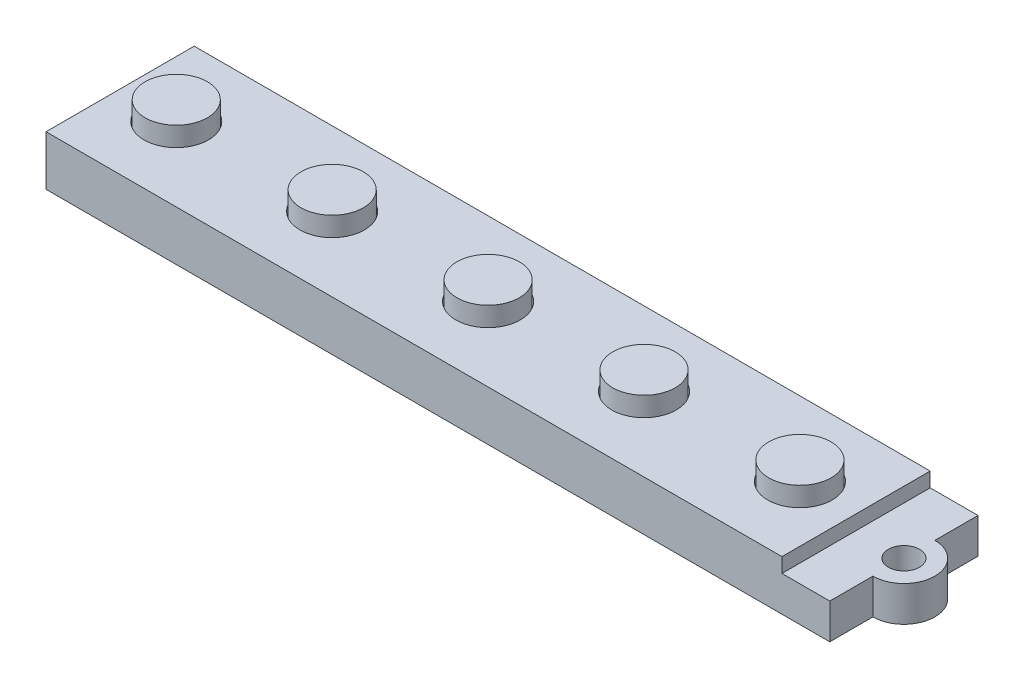
ISO-10303-21;
HEADER;
FILE_DESCRIPTION(('STEP AP214'),'2;1');
FILE_NAME('part.step','',(''),(''),'','','');
FILE_SCHEMA(('AUTOMOTIVE_DESIGN { 1 0 10303 214 1 1 1 1 }'));
ENDSEC;
DATA;
#1=APPLICATION_CONTEXT('core data for automotive mechanical design processes');
#2=APPLICATION_PROTOCOL_DEFINITION('international standard','automotive_design',2000,#1);
#3=PRODUCT_CONTEXT('',#1,'mechanical');
#4=PRODUCT('Part','Part','',(#3));
#5=PRODUCT_RELATED_PRODUCT_CATEGORY('part','',(#4));
#6=PRODUCT_DEFINITION_FORMATION('','',#4);
#7=PRODUCT_DEFINITION_CONTEXT('part definition',#1,'design');
#8=PRODUCT_DEFINITION('design','',#6,#7);
#9=PRODUCT_DEFINITION_SHAPE('','',#8);
#10=(LENGTH_UNIT() NAMED_UNIT(*) SI_UNIT(.MILLI.,.METRE.));
#11=(NAMED_UNIT(*) PLANE_ANGLE_UNIT() SI_UNIT($,.RADIAN.));
#12=(NAMED_UNIT(*) SI_UNIT($,.STERADIAN.) SOLID_ANGLE_UNIT());
#13=UNCERTAINTY_MEASURE_WITH_UNIT(LENGTH_MEASURE(1.E-05),#10,'distance_accuracy_value','');
#14=(GEOMETRIC_REPRESENTATION_CONTEXT(3) GLOBAL_UNCERTAINTY_ASSIGNED_CONTEXT((#13)) GLOBAL_UNIT_ASSIGNED_CONTEXT((#10,
#11,#12)) REPRESENTATION_CONTEXT('',''));
#15=CARTESIAN_POINT('',(0.,0.,0.));
#16=DIRECTION('',(0.,0.,1.));
#17=DIRECTION('',(1.,0.,0.));
#18=AXIS2_PLACEMENT_3D('',#15,#16,#17);
#19=CARTESIAN_POINT('',(0.,0.,0.));
#20=DIRECTION('',(0.,1.,0.));
#21=DIRECTION('',(0.,0.,1.));
#22=AXIS2_PLACEMENT_3D('',#19,#20,#21);
#23=PLANE('',#22);
#24=CARTESIAN_POINT('',(-20.4046666666667,0.,-25.8942737373737));
#25=DIRECTION('',(0.,1.,0.));
#26=DIRECTION('',(0.,0.,1.));
#27=AXIS2_PLACEMENT_3D('',#24,#25,#26);
#28=CIRCLE('',#27,1.905);
#29=CARTESIAN_POINT('',(-20.4046666666667,0.,-23.9892737373737));
#30=VERTEX_POINT('',#29);
#31=EDGE_CURVE('E224',#30,#30,#28,.T.);
#32=ORIENTED_EDGE('',*,*,#31,.T.);
#33=EDGE_LOOP('',(#32));
#34=FACE_BOUND('',#33,.T.);
#35=DIRECTION('',(0.,0.,-1.));
#36=VECTOR('',#35,1.);
#37=CARTESIAN_POINT('',(-112.479666666667,0.,-32.2442737373737));
#38=LINE('',#37,#36);
#39=CARTESIAN_POINT('',(-112.479666666667,0.,-19.5442737373737));
#40=VERTEX_POINT('',#39);
#41=CARTESIAN_POINT('',(-112.479666666667,0.,-32.2442737373737));
#42=VERTEX_POINT('',#41);
#43=EDGE_CURVE('E163',#40,#42,#38,.T.);
#44=ORIENTED_EDGE('',*,*,#43,.F.);
#45=DIRECTION('',(-1.,0.,0.));
#46=VECTOR('',#45,1.);
#47=CARTESIAN_POINT('',(-29.9296666666666,0.,-19.5442737373737));
#48=LINE('',#47,#46);
#49=CARTESIAN_POINT('',(-29.9296666666666,0.,-19.5442737373737));
#50=VERTEX_POINT('',#49);
#51=EDGE_CURVE('E168',#50,#40,#48,.T.);
#52=ORIENTED_EDGE('',*,*,#51,.F.);
#53=DIRECTION('',(0.,0.,1.));
#54=VECTOR('',#53,1.);
#55=CARTESIAN_POINT('',(-29.9296666666666,0.,-32.2442737373737));
#56=LINE('',#55,#54);
#57=CARTESIAN_POINT('',(-29.9296666666666,0.,-32.2442737373737));
#58=VERTEX_POINT('',#57);
#59=EDGE_CURVE('E178',#58,#50,#56,.T.);
#60=ORIENTED_EDGE('',*,*,#59,.F.);
#61=DIRECTION('',(1.,0.,0.));
#62=VECTOR('',#61,1.);
#63=CARTESIAN_POINT('',(-29.9296666666666,0.,-32.2442737373737));
#64=LINE('',#63,#62);
#65=EDGE_CURVE('E61',#42,#58,#64,.T.);
#66=ORIENTED_EDGE('',*,*,#65,.F.);
#67=EDGE_LOOP('',(#44,#52,#60,#66));
#68=FACE_BOUND('',#67,.T.);
#69=DIRECTION('',(-1.,0.,0.));
#70=VECTOR('',#69,1.);
#71=CARTESIAN_POINT('',(-116.162666666667,0.,-34.9493737373737));
#72=LINE('',#71,#70);
#73=CARTESIAN_POINT('',(-20.4046666666667,0.,-34.9493737373737));
#74=VERTEX_POINT('',#73);
#75=CARTESIAN_POINT('',(-116.162666666667,0.,-34.9493737373737));
#76=VERTEX_POINT('',#75);
#77=EDGE_CURVE('E246',#74,#76,#72,.T.);
#78=ORIENTED_EDGE('',*,*,#77,.F.);
#79=DIRECTION('',(0.,0.,1.));
#80=VECTOR('',#79,1.);
#81=CARTESIAN_POINT('',(-20.4046666666667,0.,0.));
#82=LINE('',#81,#80);
#83=CARTESIAN_POINT('',(-20.4046666666667,0.,-29.6800450522713));
#84=VERTEX_POINT('',#83);
#85=EDGE_CURVE('E160',#74,#84,#82,.T.);
#86=ORIENTED_EDGE('',*,*,#85,.T.);
#87=CARTESIAN_POINT('',(-20.4046666666667,0.,-25.8942737373737));
#88=DIRECTION('',(0.,1.,0.));
#89=DIRECTION('',(0.,0.,1.));
#90=AXIS2_PLACEMENT_3D('',#87,#88,#89);
#91=CIRCLE('',#90,3.78577131489756);
#92=CARTESIAN_POINT('',(-20.4046666666667,0.,-22.1085024224762));
#93=VERTEX_POINT('',#92);
#94=EDGE_CURVE('E156',#84,#93,#91,.F.);
#95=ORIENTED_EDGE('',*,*,#94,.T.);
#96=DIRECTION('',(0.,0.,1.));
#97=VECTOR('',#96,1.);
#98=CARTESIAN_POINT('',(-20.4046666666666,0.,0.));
#99=LINE('',#98,#97);
#100=CARTESIAN_POINT('',(-20.4046666666666,0.,-16.8391737373737));
#101=VERTEX_POINT('',#100);
#102=EDGE_CURVE('E134',#93,#101,#99,.T.);
#103=ORIENTED_EDGE('',*,*,#102,.T.);
#104=DIRECTION('',(1.,0.,0.));
#105=VECTOR('',#104,1.);
#106=CARTESIAN_POINT('',(-116.162666666667,0.,-16.8391737373737));
#107=LINE('',#106,#105);
#108=CARTESIAN_POINT('',(-116.162666666667,0.,-16.8391737373737));
#109=VERTEX_POINT('',#108);
#110=EDGE_CURVE('E253',#109,#101,#107,.T.);
#111=ORIENTED_EDGE('',*,*,#110,.F.);
#112=DIRECTION('',(0.,0.,1.));
#113=VECTOR('',#112,1.);
#114=CARTESIAN_POINT('',(-116.162666666667,0.,-34.9493737373737));
#115=LINE('',#114,#113);
#116=EDGE_CURVE('E239',#76,#109,#115,.T.);
#117=ORIENTED_EDGE('',*,*,#116,.F.);
#118=EDGE_LOOP('',(#78,#86,#95,#103,#111,#117));
#119=FACE_BOUND('',#118,.T.);
#120=ADVANCED_FACE('F38',(#34,#68,#119),#23,.F.);
#121=CARTESIAN_POINT('',(0.,4.318,0.));
#122=DIRECTION('',(0.,1.,0.));
#123=DIRECTION('',(0.,0.,1.));
#124=AXIS2_PLACEMENT_3D('',#121,#122,#123);
#125=PLANE('',#124);
#126=CARTESIAN_POINT('',(-20.4046666666667,4.318,-25.8942737373737));
#127=DIRECTION('',(0.,1.,0.));
#128=DIRECTION('',(0.,0.,1.));
#129=AXIS2_PLACEMENT_3D('',#126,#127,#128);
#130=CIRCLE('',#129,1.905);
#131=CARTESIAN_POINT('',(-20.4046666666667,4.318,-23.9892737373737));
#132=VERTEX_POINT('',#131);
#133=EDGE_CURVE('E221',#132,#132,#130,.T.);
#134=ORIENTED_EDGE('',*,*,#133,.F.);
#135=EDGE_LOOP('',(#134));
#136=FACE_BOUND('',#135,.T.);
#137=DIRECTION('',(0.,0.,1.));
#138=VECTOR('',#137,1.);
#139=CARTESIAN_POINT('',(-20.4046666666667,4.318,-34.9493737373737));
#140=LINE('',#139,#138);
#141=CARTESIAN_POINT('',(-20.4046666666667,4.318,-34.9493737373737));
#142=VERTEX_POINT('',#141);
#143=CARTESIAN_POINT('',(-20.4046666666667,4.318,-29.6800450522713));
#144=VERTEX_POINT('',#143);
#145=EDGE_CURVE('E53',#142,#144,#140,.T.);
#146=ORIENTED_EDGE('',*,*,#145,.F.);
#147=DIRECTION('',(-1.,0.,0.));
#148=VECTOR('',#147,1.);
#149=CARTESIAN_POINT('',(-26.2466666666667,4.318,-34.9493737373737));
#150=LINE('',#149,#148);
#151=CARTESIAN_POINT('',(-26.2466666666667,4.318,-34.9493737373737));
#152=VERTEX_POINT('',#151);
#153=EDGE_CURVE('E233',#142,#152,#150,.T.);
#154=ORIENTED_EDGE('',*,*,#153,.T.);
#155=DIRECTION('',(0.,0.,1.));
#156=VECTOR('',#155,1.);
#157=CARTESIAN_POINT('',(-26.2466666666667,4.318,-34.9493737373737));
#158=LINE('',#157,#156);
#159=CARTESIAN_POINT('',(-26.2466666666667,4.318,-16.8391737373737));
#160=VERTEX_POINT('',#159);
#161=EDGE_CURVE('E230',#152,#160,#158,.T.);
#162=ORIENTED_EDGE('',*,*,#161,.T.);
#163=DIRECTION('',(1.,0.,0.));
#164=VECTOR('',#163,1.);
#165=CARTESIAN_POINT('',(-26.2466666666667,4.318,-16.8391737373737));
#166=LINE('',#165,#164);
#167=CARTESIAN_POINT('',(-20.4046666666666,4.318,-16.8391737373737));
#168=VERTEX_POINT('',#167);
#169=EDGE_CURVE('E149',#160,#168,#166,.T.);
#170=ORIENTED_EDGE('',*,*,#169,.T.);
#171=DIRECTION('',(0.,0.,1.));
#172=VECTOR('',#171,1.);
#173=CARTESIAN_POINT('',(-20.4046666666667,4.318,-22.1085024224762));
#174=LINE('',#173,#172);
#175=CARTESIAN_POINT('',(-20.4046666666667,4.318,-22.1085024224762));
#176=VERTEX_POINT('',#175);
#177=EDGE_CURVE('E131',#176,#168,#174,.T.);
#178=ORIENTED_EDGE('',*,*,#177,.F.);
#179=CARTESIAN_POINT('',(-20.4046666666667,4.318,-25.8942737373737));
#180=DIRECTION('',(0.,-1.,0.));
#181=DIRECTION('',(0.,0.,1.));
#182=AXIS2_PLACEMENT_3D('',#179,#180,#181);
#183=CIRCLE('',#182,3.78577131489756);
#184=EDGE_CURVE('E141',#144,#176,#183,.T.);
#185=ORIENTED_EDGE('',*,*,#184,.F.);
#186=EDGE_LOOP('',(#146,#154,#162,#170,#178,#185));
#187=FACE_BOUND('',#186,.T.);
#188=ADVANCED_FACE('F146',(#136,#187),#125,.T.);
#189=CARTESIAN_POINT('',(-116.162666666667,6.096,-34.9493737373737));
#190=DIRECTION('',(1.,0.,0.));
#191=DIRECTION('',(0.,0.,-1.));
#192=AXIS2_PLACEMENT_3D('',#189,#190,#191);
#193=PLANE('',#192);
#194=ORIENTED_EDGE('',*,*,#116,.T.);
#195=DIRECTION('',(0.,-1.,0.));
#196=VECTOR('',#195,1.);
#197=CARTESIAN_POINT('',(-116.162666666667,6.096,-16.8391737373737));
#198=LINE('',#197,#196);
#199=CARTESIAN_POINT('',(-116.162666666667,6.096,-16.8391737373737));
#200=VERTEX_POINT('',#199);
#201=EDGE_CURVE('E11',#200,#109,#198,.T.);
#202=ORIENTED_EDGE('',*,*,#201,.F.);
#203=DIRECTION('',(0.,0.,1.));
#204=VECTOR('',#203,1.);
#205=CARTESIAN_POINT('',(-116.162666666667,6.096,-34.9493737373737));
#206=LINE('',#205,#204);
#207=CARTESIAN_POINT('',(-116.162666666667,6.096,-34.9493737373737));
#208=VERTEX_POINT('',#207);
#209=EDGE_CURVE('E242',#208,#200,#206,.T.);
#210=ORIENTED_EDGE('',*,*,#209,.F.);
#211=DIRECTION('',(0.,-1.,0.));
#212=VECTOR('',#211,1.);
#213=CARTESIAN_POINT('',(-116.162666666667,6.096,-34.9493737373737));
#214=LINE('',#213,#212);
#215=EDGE_CURVE('E46',#208,#76,#214,.T.);
#216=ORIENTED_EDGE('',*,*,#215,.T.);
#217=EDGE_LOOP('',(#194,#202,#210,#216));
#218=FACE_BOUND('',#217,.T.);
#219=ADVANCED_FACE('F40',(#218),#193,.F.);
#220=CARTESIAN_POINT('',(-116.162666666667,6.096,-16.8391737373737));
#221=DIRECTION('',(0.,0.,-1.));
#222=DIRECTION('',(-1.,0.,0.));
#223=AXIS2_PLACEMENT_3D('',#220,#221,#222);
#224=PLANE('',#223);
#225=ORIENTED_EDGE('',*,*,#110,.T.);
#226=DIRECTION('',(0.,1.,0.));
#227=VECTOR('',#226,1.);
#228=CARTESIAN_POINT('',(-20.4046666666666,-1.27,-16.8391737373737));
#229=LINE('',#228,#227);
#230=EDGE_CURVE('E137',#101,#168,#229,.T.);
#231=ORIENTED_EDGE('',*,*,#230,.T.);
#232=ORIENTED_EDGE('',*,*,#169,.F.);
#233=DIRECTION('',(0.,1.,0.));
#234=VECTOR('',#233,1.);
#235=CARTESIAN_POINT('',(-26.2466666666667,4.318,-16.8391737373737));
#236=LINE('',#235,#234);
#237=CARTESIAN_POINT('',(-26.2466666666667,6.096,-16.8391737373737));
#238=VERTEX_POINT('',#237);
#239=EDGE_CURVE('E235',#160,#238,#236,.T.);
#240=ORIENTED_EDGE('',*,*,#239,.T.);
#241=DIRECTION('',(1.,0.,0.));
#242=VECTOR('',#241,1.);
#243=CARTESIAN_POINT('',(-116.162666666667,6.096,-16.8391737373737));
#244=LINE('',#243,#242);
#245=EDGE_CURVE('E245',#200,#238,#244,.T.);
#246=ORIENTED_EDGE('',*,*,#245,.F.);
#247=ORIENTED_EDGE('',*,*,#201,.T.);
#248=EDGE_LOOP('',(#225,#231,#232,#240,#246,#247));
#249=FACE_BOUND('',#248,.T.);
#250=ADVANCED_FACE('F267',(#249),#224,.F.);
#251=CARTESIAN_POINT('',(-116.162666666667,6.096,-34.9493737373737));
#252=DIRECTION('',(0.,0.,1.));
#253=DIRECTION('',(1.,0.,0.));
#254=AXIS2_PLACEMENT_3D('',#251,#252,#253);
#255=PLANE('',#254);
#256=ORIENTED_EDGE('',*,*,#153,.F.);
#257=DIRECTION('',(0.,1.,0.));
#258=VECTOR('',#257,1.);
#259=CARTESIAN_POINT('',(-20.4046666666667,-1.27,-34.9493737373737));
#260=LINE('',#259,#258);
#261=EDGE_CURVE('E154',#74,#142,#260,.T.);
#262=ORIENTED_EDGE('',*,*,#261,.F.);
#263=ORIENTED_EDGE('',*,*,#77,.T.);
#264=ORIENTED_EDGE('',*,*,#215,.F.);
#265=DIRECTION('',(-1.,0.,0.));
#266=VECTOR('',#265,1.);
#267=CARTESIAN_POINT('',(-116.162666666667,6.096,-34.9493737373737));
#268=LINE('',#267,#266);
#269=CARTESIAN_POINT('',(-26.2466666666667,6.096,-34.9493737373737));
#270=VERTEX_POINT('',#269);
#271=EDGE_CURVE('E249',#270,#208,#268,.T.);
#272=ORIENTED_EDGE('',*,*,#271,.F.);
#273=DIRECTION('',(0.,1.,0.));
#274=VECTOR('',#273,1.);
#275=CARTESIAN_POINT('',(-26.2466666666667,4.318,-34.9493737373737));
#276=LINE('',#275,#274);
#277=EDGE_CURVE('E237',#152,#270,#276,.T.);
#278=ORIENTED_EDGE('',*,*,#277,.F.);
#279=EDGE_LOOP('',(#256,#262,#263,#264,#272,#278));
#280=FACE_BOUND('',#279,.T.);
#281=ADVANCED_FACE('F273',(#280),#255,.F.);
#282=CARTESIAN_POINT('',(0.,6.096,0.));
#283=DIRECTION('',(0.,1.,0.));
#284=DIRECTION('',(0.,0.,1.));
#285=AXIS2_PLACEMENT_3D('',#282,#283,#284);
#286=PLANE('',#285);
#287=CARTESIAN_POINT('',(-52.1546666666667,6.096,-25.8942737373736));
#288=DIRECTION('',(0.,1.,0.));
#289=DIRECTION('',(0.,0.,1.));
#290=AXIS2_PLACEMENT_3D('',#287,#288,#289);
#291=CIRCLE('',#290,3.937);
#292=CARTESIAN_POINT('',(-52.1546666666667,6.096,-21.9572737373736));
#293=VERTEX_POINT('',#292);
#294=EDGE_CURVE('E198',#293,#293,#291,.T.);
#295=ORIENTED_EDGE('',*,*,#294,.F.);
#296=EDGE_LOOP('',(#295));
#297=FACE_BOUND('',#296,.T.);
#298=CARTESIAN_POINT('',(-71.2046666666667,6.096,-25.8942737373734));
#299=DIRECTION('',(0.,1.,0.));
#300=DIRECTION('',(0.,0.,1.));
#301=AXIS2_PLACEMENT_3D('',#298,#299,#300);
#302=CIRCLE('',#301,3.937);
#303=CARTESIAN_POINT('',(-71.2046666666667,6.096,-21.9572737373734));
#304=VERTEX_POINT('',#303);
#305=EDGE_CURVE('E204',#304,#304,#302,.T.);
#306=ORIENTED_EDGE('',*,*,#305,.F.);
#307=EDGE_LOOP('',(#306));
#308=FACE_BOUND('',#307,.T.);
#309=CARTESIAN_POINT('',(-90.2546666666667,6.096,-25.8942737373733));
#310=DIRECTION('',(0.,1.,0.));
#311=DIRECTION('',(0.,0.,1.));
#312=AXIS2_PLACEMENT_3D('',#309,#310,#311);
#313=CIRCLE('',#312,3.937);
#314=CARTESIAN_POINT('',(-90.2546666666667,6.096,-21.9572737373733));
#315=VERTEX_POINT('',#314);
#316=EDGE_CURVE('E210',#315,#315,#313,.T.);
#317=ORIENTED_EDGE('',*,*,#316,.F.);
#318=EDGE_LOOP('',(#317));
#319=FACE_BOUND('',#318,.T.);
#320=CARTESIAN_POINT('',(-109.304666666667,6.096,-25.8942737373732));
#321=DIRECTION('',(0.,1.,0.));
#322=DIRECTION('',(0.,0.,1.));
#323=AXIS2_PLACEMENT_3D('',#320,#321,#322);
#324=CIRCLE('',#323,3.937);
#325=CARTESIAN_POINT('',(-109.304666666667,6.096,-21.9572737373732));
#326=VERTEX_POINT('',#325);
#327=EDGE_CURVE('E193',#326,#326,#324,.T.);
#328=ORIENTED_EDGE('',*,*,#327,.F.);
#329=EDGE_LOOP('',(#328));
#330=FACE_BOUND('',#329,.T.);
#331=CARTESIAN_POINT('',(-33.1046666666667,6.096,-25.8942737373737));
#332=DIRECTION('',(0.,1.,0.));
#333=DIRECTION('',(0.,0.,1.));
#334=AXIS2_PLACEMENT_3D('',#331,#332,#333);
#335=CIRCLE('',#334,3.937);
#336=CARTESIAN_POINT('',(-33.1046666666667,6.096,-21.9572737373737));
#337=VERTEX_POINT('',#336);
#338=EDGE_CURVE('E197',#337,#337,#335,.T.);
#339=ORIENTED_EDGE('',*,*,#338,.F.);
#340=EDGE_LOOP('',(#339));
#341=FACE_BOUND('',#340,.T.);
#342=DIRECTION('',(0.,0.,1.));
#343=VECTOR('',#342,1.);
#344=CARTESIAN_POINT('',(-26.2466666666667,6.096,-34.9493737373737));
#345=LINE('',#344,#343);
#346=EDGE_CURVE('E227',#270,#238,#345,.T.);
#347=ORIENTED_EDGE('',*,*,#346,.F.);
#348=ORIENTED_EDGE('',*,*,#271,.T.);
#349=ORIENTED_EDGE('',*,*,#209,.T.);
#350=ORIENTED_EDGE('',*,*,#245,.T.);
#351=EDGE_LOOP('',(#347,#348,#349,#350));
#352=FACE_BOUND('',#351,.T.);
#353=ADVANCED_FACE('F270',(#297,#308,#319,#330,#341,#352),#286,.T.);
#354=CARTESIAN_POINT('',(-26.2466666666667,4.318,-34.9493737373737));
#355=DIRECTION('',(-1.,0.,0.));
#356=DIRECTION('',(0.,0.,1.));
#357=AXIS2_PLACEMENT_3D('',#354,#355,#356);
#358=PLANE('',#357);
#359=ORIENTED_EDGE('',*,*,#346,.T.);
#360=ORIENTED_EDGE('',*,*,#239,.F.);
#361=ORIENTED_EDGE('',*,*,#161,.F.);
#362=ORIENTED_EDGE('',*,*,#277,.T.);
#363=EDGE_LOOP('',(#359,#360,#361,#362));
#364=FACE_BOUND('',#363,.T.);
#365=ADVANCED_FACE('F277',(#364),#358,.F.);
#366=CARTESIAN_POINT('',(-20.4046666666667,0.,-25.8942737373737));
#367=DIRECTION('',(0.,1.,0.));
#368=DIRECTION('',(0.,0.,1.));
#369=AXIS2_PLACEMENT_3D('',#366,#367,#368);
#370=CYLINDRICAL_SURFACE('',#369,1.905);
#371=ORIENTED_EDGE('',*,*,#31,.F.);
#372=EDGE_LOOP('',(#371));
#373=FACE_BOUND('',#372,.T.);
#374=ORIENTED_EDGE('',*,*,#133,.T.);
#375=EDGE_LOOP('',(#374));
#376=FACE_BOUND('',#375,.T.);
#377=ADVANCED_FACE('F341',(#373,#376),#370,.F.);
#378=CARTESIAN_POINT('',(-33.1046666666667,4.826,-25.8942737373737));
#379=DIRECTION('',(0.,1.,0.));
#380=DIRECTION('',(0.,0.,1.));
#381=AXIS2_PLACEMENT_3D('',#378,#379,#380);
#382=CYLINDRICAL_SURFACE('',#381,3.937);
#383=CARTESIAN_POINT('',(-33.1046666666667,4.826,-25.8942737373737));
#384=DIRECTION('',(0.,1.,0.));
#385=DIRECTION('',(0.,0.,1.));
#386=AXIS2_PLACEMENT_3D('',#383,#384,#385);
#387=CIRCLE('',#386,3.937);
#388=CARTESIAN_POINT('',(-33.1046666666667,4.826,-21.9572737373737));
#389=VERTEX_POINT('',#388);
#390=EDGE_CURVE('E218',#389,#389,#387,.T.);
#391=ORIENTED_EDGE('',*,*,#390,.F.);
#392=EDGE_LOOP('',(#391));
#393=FACE_BOUND('',#392,.T.);
#394=ORIENTED_EDGE('',*,*,#338,.T.);
#395=EDGE_LOOP('',(#394));
#396=FACE_BOUND('',#395,.T.);
#397=ADVANCED_FACE('F339',(#393,#396),#382,.F.);
#398=CARTESIAN_POINT('',(-33.1046666666667,4.826,-25.8942737373737));
#399=DIRECTION('',(0.,1.,0.));
#400=DIRECTION('',(0.,0.,1.));
#401=AXIS2_PLACEMENT_3D('',#398,#399,#400);
#402=PLANE('',#401);
#403=CARTESIAN_POINT('',(-33.1046666666667,4.826,-25.8942737373737));
#404=DIRECTION('',(0.,1.,0.));
#405=DIRECTION('',(0.,0.,1.));
#406=AXIS2_PLACEMENT_3D('',#403,#404,#405);
#407=CIRCLE('',#406,3.81);
#408=CARTESIAN_POINT('',(-33.1046666666667,4.826,-22.0842737373737));
#409=VERTEX_POINT('',#408);
#410=EDGE_CURVE('E280',#409,#409,#407,.T.);
#411=ORIENTED_EDGE('',*,*,#410,.F.);
#412=EDGE_LOOP('',(#411));
#413=FACE_BOUND('',#412,.T.);
#414=ORIENTED_EDGE('',*,*,#390,.T.);
#415=EDGE_LOOP('',(#414));
#416=FACE_BOUND('',#415,.T.);
#417=ADVANCED_FACE('F329',(#413,#416),#402,.T.);
#418=CARTESIAN_POINT('',(-109.304666666667,4.826,-25.8942737373732));
#419=DIRECTION('',(0.,1.,0.));
#420=DIRECTION('',(0.,0.,1.));
#421=AXIS2_PLACEMENT_3D('',#418,#419,#420);
#422=CYLINDRICAL_SURFACE('',#421,3.937);
#423=CARTESIAN_POINT('',(-109.304666666667,4.826,-25.8942737373732));
#424=DIRECTION('',(0.,1.,0.));
#425=DIRECTION('',(0.,0.,1.));
#426=AXIS2_PLACEMENT_3D('',#423,#424,#425);
#427=CIRCLE('',#426,3.937);
#428=CARTESIAN_POINT('',(-109.304666666667,4.826,-21.9572737373732));
#429=VERTEX_POINT('',#428);
#430=EDGE_CURVE('E213',#429,#429,#427,.T.);
#431=ORIENTED_EDGE('',*,*,#430,.F.);
#432=EDGE_LOOP('',(#431));
#433=FACE_BOUND('',#432,.T.);
#434=ORIENTED_EDGE('',*,*,#327,.T.);
#435=EDGE_LOOP('',(#434));
#436=FACE_BOUND('',#435,.T.);
#437=ADVANCED_FACE('F323',(#433,#436),#422,.F.);
#438=CARTESIAN_POINT('',(-109.304666666667,4.826,-25.8942737373732));
#439=DIRECTION('',(0.,1.,0.));
#440=DIRECTION('',(0.,0.,1.));
#441=AXIS2_PLACEMENT_3D('',#438,#439,#440);
#442=PLANE('',#441);
#443=CARTESIAN_POINT('',(-109.304666666667,4.826,-25.8942737373732));
#444=DIRECTION('',(0.,1.,0.));
#445=DIRECTION('',(0.,0.,1.));
#446=AXIS2_PLACEMENT_3D('',#443,#444,#445);
#447=CIRCLE('',#446,3.81);
#448=CARTESIAN_POINT('',(-109.304666666667,4.826,-22.0842737373732));
#449=VERTEX_POINT('',#448);
#450=EDGE_CURVE('E304',#449,#449,#447,.T.);
#451=ORIENTED_EDGE('',*,*,#450,.F.);
#452=EDGE_LOOP('',(#451));
#453=FACE_BOUND('',#452,.T.);
#454=ORIENTED_EDGE('',*,*,#430,.T.);
#455=EDGE_LOOP('',(#454));
#456=FACE_BOUND('',#455,.T.);
#457=ADVANCED_FACE('F319',(#453,#456),#442,.T.);
#458=CARTESIAN_POINT('',(-90.2546666666667,4.826,-25.8942737373733));
#459=DIRECTION('',(0.,1.,0.));
#460=DIRECTION('',(0.,0.,1.));
#461=AXIS2_PLACEMENT_3D('',#458,#459,#460);
#462=CYLINDRICAL_SURFACE('',#461,3.937);
#463=CARTESIAN_POINT('',(-90.2546666666667,4.826,-25.8942737373733));
#464=DIRECTION('',(0.,1.,0.));
#465=DIRECTION('',(0.,0.,1.));
#466=AXIS2_PLACEMENT_3D('',#463,#464,#465);
#467=CIRCLE('',#466,3.937);
#468=CARTESIAN_POINT('',(-90.2546666666667,4.826,-21.9572737373733));
#469=VERTEX_POINT('',#468);
#470=EDGE_CURVE('E207',#469,#469,#467,.T.);
#471=ORIENTED_EDGE('',*,*,#470,.F.);
#472=EDGE_LOOP('',(#471));
#473=FACE_BOUND('',#472,.T.);
#474=ORIENTED_EDGE('',*,*,#316,.T.);
#475=EDGE_LOOP('',(#474));
#476=FACE_BOUND('',#475,.T.);
#477=ADVANCED_FACE('F322',(#473,#476),#462,.F.);
#478=CARTESIAN_POINT('',(-90.2546666666667,4.826,-25.8942737373733));
#479=DIRECTION('',(0.,1.,0.));
#480=DIRECTION('',(0.,0.,1.));
#481=AXIS2_PLACEMENT_3D('',#478,#479,#480);
#482=PLANE('',#481);
#483=CARTESIAN_POINT('',(-90.2546666666667,4.826,-25.8942737373733));
#484=DIRECTION('',(0.,1.,0.));
#485=DIRECTION('',(0.,0.,1.));
#486=AXIS2_PLACEMENT_3D('',#483,#484,#485);
#487=CIRCLE('',#486,3.81);
#488=CARTESIAN_POINT('',(-90.2546666666667,4.826,-22.0842737373733));
#489=VERTEX_POINT('',#488);
#490=EDGE_CURVE('E298',#489,#489,#487,.T.);
#491=ORIENTED_EDGE('',*,*,#490,.F.);
#492=EDGE_LOOP('',(#491));
#493=FACE_BOUND('',#492,.T.);
#494=ORIENTED_EDGE('',*,*,#470,.T.);
#495=EDGE_LOOP('',(#494));
#496=FACE_BOUND('',#495,.T.);
#497=ADVANCED_FACE('F467',(#493,#496),#482,.T.);
#498=CARTESIAN_POINT('',(-71.2046666666667,4.826,-25.8942737373734));
#499=DIRECTION('',(0.,1.,0.));
#500=DIRECTION('',(0.,0.,1.));
#501=AXIS2_PLACEMENT_3D('',#498,#499,#500);
#502=CYLINDRICAL_SURFACE('',#501,3.937);
#503=CARTESIAN_POINT('',(-71.2046666666667,4.826,-25.8942737373734));
#504=DIRECTION('',(0.,1.,0.));
#505=DIRECTION('',(0.,0.,1.));
#506=AXIS2_PLACEMENT_3D('',#503,#504,#505);
#507=CIRCLE('',#506,3.937);
#508=CARTESIAN_POINT('',(-71.2046666666667,4.826,-21.9572737373734));
#509=VERTEX_POINT('',#508);
#510=EDGE_CURVE('E201',#509,#509,#507,.T.);
#511=ORIENTED_EDGE('',*,*,#510,.F.);
#512=EDGE_LOOP('',(#511));
#513=FACE_BOUND('',#512,.T.);
#514=ORIENTED_EDGE('',*,*,#305,.T.);
#515=EDGE_LOOP('',(#514));
#516=FACE_BOUND('',#515,.T.);
#517=ADVANCED_FACE('F461',(#513,#516),#502,.F.);
#518=CARTESIAN_POINT('',(-71.2046666666667,4.826,-25.8942737373734));
#519=DIRECTION('',(0.,1.,0.));
#520=DIRECTION('',(0.,0.,1.));
#521=AXIS2_PLACEMENT_3D('',#518,#519,#520);
#522=PLANE('',#521);
#523=CARTESIAN_POINT('',(-71.2046666666667,4.826,-25.8942737373734));
#524=DIRECTION('',(0.,1.,0.));
#525=DIRECTION('',(0.,0.,1.));
#526=AXIS2_PLACEMENT_3D('',#523,#524,#525);
#527=CIRCLE('',#526,3.81000000000001);
#528=CARTESIAN_POINT('',(-71.2046666666667,4.826,-22.0842737373734));
#529=VERTEX_POINT('',#528);
#530=EDGE_CURVE('E292',#529,#529,#527,.T.);
#531=ORIENTED_EDGE('',*,*,#530,.F.);
#532=EDGE_LOOP('',(#531));
#533=FACE_BOUND('',#532,.T.);
#534=ORIENTED_EDGE('',*,*,#510,.T.);
#535=EDGE_LOOP('',(#534));
#536=FACE_BOUND('',#535,.T.);
#537=ADVANCED_FACE('F453',(#533,#536),#522,.T.);
#538=CARTESIAN_POINT('',(-52.1546666666667,4.826,-25.8942737373736));
#539=DIRECTION('',(0.,1.,0.));
#540=DIRECTION('',(0.,0.,1.));
#541=AXIS2_PLACEMENT_3D('',#538,#539,#540);
#542=CYLINDRICAL_SURFACE('',#541,3.937);
#543=CARTESIAN_POINT('',(-52.1546666666667,4.826,-25.8942737373736));
#544=DIRECTION('',(0.,1.,0.));
#545=DIRECTION('',(0.,0.,1.));
#546=AXIS2_PLACEMENT_3D('',#543,#544,#545);
#547=CIRCLE('',#546,3.937);
#548=CARTESIAN_POINT('',(-52.1546666666667,4.826,-21.9572737373736));
#549=VERTEX_POINT('',#548);
#550=EDGE_CURVE('E194',#549,#549,#547,.T.);
#551=ORIENTED_EDGE('',*,*,#550,.F.);
#552=EDGE_LOOP('',(#551));
#553=FACE_BOUND('',#552,.T.);
#554=ORIENTED_EDGE('',*,*,#294,.T.);
#555=EDGE_LOOP('',(#554));
#556=FACE_BOUND('',#555,.T.);
#557=ADVANCED_FACE('F447',(#553,#556),#542,.F.);
#558=CARTESIAN_POINT('',(-52.1546666666667,4.826,-25.8942737373736));
#559=DIRECTION('',(0.,1.,0.));
#560=DIRECTION('',(0.,0.,1.));
#561=AXIS2_PLACEMENT_3D('',#558,#559,#560);
#562=PLANE('',#561);
#563=CARTESIAN_POINT('',(-52.1546666666667,4.826,-25.8942737373736));
#564=DIRECTION('',(0.,1.,0.));
#565=DIRECTION('',(0.,0.,1.));
#566=AXIS2_PLACEMENT_3D('',#563,#564,#565);
#567=CIRCLE('',#566,3.81);
#568=CARTESIAN_POINT('',(-52.1546666666667,4.826,-22.0842737373736));
#569=VERTEX_POINT('',#568);
#570=EDGE_CURVE('E286',#569,#569,#567,.T.);
#571=ORIENTED_EDGE('',*,*,#570,.F.);
#572=EDGE_LOOP('',(#571));
#573=FACE_BOUND('',#572,.T.);
#574=ORIENTED_EDGE('',*,*,#550,.T.);
#575=EDGE_LOOP('',(#574));
#576=FACE_BOUND('',#575,.T.);
#577=ADVANCED_FACE('F439',(#573,#576),#562,.T.);
#578=CARTESIAN_POINT('',(-112.479666666667,-1.27,-32.2442737373737));
#579=DIRECTION('',(1.,0.,0.));
#580=DIRECTION('',(0.,0.,-1.));
#581=AXIS2_PLACEMENT_3D('',#578,#579,#580);
#582=PLANE('',#581);
#583=ORIENTED_EDGE('',*,*,#43,.T.);
#584=DIRECTION('',(0.,1.,0.));
#585=VECTOR('',#584,1.);
#586=CARTESIAN_POINT('',(-112.479666666667,-1.27,-32.2442737373737));
#587=LINE('',#586,#585);
#588=CARTESIAN_POINT('',(-112.479666666667,-1.27,-32.2442737373737));
#589=VERTEX_POINT('',#588);
#590=EDGE_CURVE('E191',#589,#42,#587,.T.);
#591=ORIENTED_EDGE('',*,*,#590,.F.);
#592=DIRECTION('',(0.,0.,-1.));
#593=VECTOR('',#592,1.);
#594=CARTESIAN_POINT('',(-112.479666666667,-1.27,-32.2442737373737));
#595=LINE('',#594,#593);
#596=CARTESIAN_POINT('',(-112.479666666667,-1.27,-19.5442737373737));
#597=VERTEX_POINT('',#596);
#598=EDGE_CURVE('E164',#597,#589,#595,.T.);
#599=ORIENTED_EDGE('',*,*,#598,.F.);
#600=DIRECTION('',(0.,1.,0.));
#601=VECTOR('',#600,1.);
#602=CARTESIAN_POINT('',(-112.479666666667,-1.27,-19.5442737373737));
#603=LINE('',#602,#601);
#604=EDGE_CURVE('E174',#597,#40,#603,.T.);
#605=ORIENTED_EDGE('',*,*,#604,.T.);
#606=EDGE_LOOP('',(#583,#591,#599,#605));
#607=FACE_BOUND('',#606,.T.);
#608=ADVANCED_FACE('F428',(#607),#582,.F.);
#609=CARTESIAN_POINT('',(-29.9296666666666,-1.27,-32.2442737373737));
#610=DIRECTION('',(0.,0.,1.));
#611=DIRECTION('',(1.,0.,0.));
#612=AXIS2_PLACEMENT_3D('',#609,#610,#611);
#613=PLANE('',#612);
#614=ORIENTED_EDGE('',*,*,#65,.T.);
#615=DIRECTION('',(0.,1.,0.));
#616=VECTOR('',#615,1.);
#617=CARTESIAN_POINT('',(-29.9296666666666,-1.27,-32.2442737373737));
#618=LINE('',#617,#616);
#619=CARTESIAN_POINT('',(-29.9296666666666,-1.27,-32.2442737373737));
#620=VERTEX_POINT('',#619);
#621=EDGE_CURVE('E188',#620,#58,#618,.T.);
#622=ORIENTED_EDGE('',*,*,#621,.F.);
#623=DIRECTION('',(1.,0.,0.));
#624=VECTOR('',#623,1.);
#625=CARTESIAN_POINT('',(-29.9296666666666,-1.27,-32.2442737373737));
#626=LINE('',#625,#624);
#627=EDGE_CURVE('E167',#589,#620,#626,.T.);
#628=ORIENTED_EDGE('',*,*,#627,.F.);
#629=ORIENTED_EDGE('',*,*,#590,.T.);
#630=EDGE_LOOP('',(#614,#622,#628,#629));
#631=FACE_BOUND('',#630,.T.);
#632=ADVANCED_FACE('F417',(#631),#613,.F.);
#633=CARTESIAN_POINT('',(-29.9296666666666,-1.27,-32.2442737373737));
#634=DIRECTION('',(-1.,0.,0.));
#635=DIRECTION('',(0.,0.,1.));
#636=AXIS2_PLACEMENT_3D('',#633,#634,#635);
#637=PLANE('',#636);
#638=ORIENTED_EDGE('',*,*,#59,.T.);
#639=DIRECTION('',(0.,1.,0.));
#640=VECTOR('',#639,1.);
#641=CARTESIAN_POINT('',(-29.9296666666666,-1.27,-19.5442737373737));
#642=LINE('',#641,#640);
#643=CARTESIAN_POINT('',(-29.9296666666666,-1.27,-19.5442737373737));
#644=VERTEX_POINT('',#643);
#645=EDGE_CURVE('E185',#644,#50,#642,.T.);
#646=ORIENTED_EDGE('',*,*,#645,.F.);
#647=DIRECTION('',(0.,0.,1.));
#648=VECTOR('',#647,1.);
#649=CARTESIAN_POINT('',(-29.9296666666666,-1.27,-32.2442737373737));
#650=LINE('',#649,#648);
#651=EDGE_CURVE('E170',#620,#644,#650,.T.);
#652=ORIENTED_EDGE('',*,*,#651,.F.);
#653=ORIENTED_EDGE('',*,*,#621,.T.);
#654=EDGE_LOOP('',(#638,#646,#652,#653));
#655=FACE_BOUND('',#654,.T.);
#656=ADVANCED_FACE('F406',(#655),#637,.F.);
#657=CARTESIAN_POINT('',(-29.9296666666666,-1.27,-19.5442737373737));
#658=DIRECTION('',(0.,0.,-1.));
#659=DIRECTION('',(-1.,0.,0.));
#660=AXIS2_PLACEMENT_3D('',#657,#658,#659);
#661=PLANE('',#660);
#662=ORIENTED_EDGE('',*,*,#51,.T.);
#663=ORIENTED_EDGE('',*,*,#604,.F.);
#664=DIRECTION('',(-1.,0.,0.));
#665=VECTOR('',#664,1.);
#666=CARTESIAN_POINT('',(-29.9296666666666,-1.27,-19.5442737373737));
#667=LINE('',#666,#665);
#668=EDGE_CURVE('E172',#644,#597,#667,.T.);
#669=ORIENTED_EDGE('',*,*,#668,.F.);
#670=ORIENTED_EDGE('',*,*,#645,.T.);
#671=EDGE_LOOP('',(#662,#663,#669,#670));
#672=FACE_BOUND('',#671,.T.);
#673=ADVANCED_FACE('F394',(#672),#661,.F.);
#674=CARTESIAN_POINT('',(0.,-1.27,0.));
#675=DIRECTION('',(0.,-1.,0.));
#676=DIRECTION('',(0.,0.,-1.));
#677=AXIS2_PLACEMENT_3D('',#674,#675,#676);
#678=PLANE('',#677);
#679=ORIENTED_EDGE('',*,*,#598,.T.);
#680=ORIENTED_EDGE('',*,*,#627,.T.);
#681=ORIENTED_EDGE('',*,*,#651,.T.);
#682=ORIENTED_EDGE('',*,*,#668,.T.);
#683=EDGE_LOOP('',(#679,#680,#681,#682));
#684=FACE_BOUND('',#683,.T.);
#685=ADVANCED_FACE('F387',(#684),#678,.T.);
#686=CARTESIAN_POINT('',(-20.4046666666667,-1.27,-34.9493737373737));
#687=DIRECTION('',(-1.,0.,0.));
#688=DIRECTION('',(0.,0.,1.));
#689=AXIS2_PLACEMENT_3D('',#686,#687,#688);
#690=PLANE('',#689);
#691=ORIENTED_EDGE('',*,*,#261,.T.);
#692=ORIENTED_EDGE('',*,*,#145,.T.);
#693=DIRECTION('',(0.,1.,0.));
#694=VECTOR('',#693,1.);
#695=CARTESIAN_POINT('',(-20.4046666666667,-1.27,-29.6800450522713));
#696=LINE('',#695,#694);
#697=EDGE_CURVE('E138',#84,#144,#696,.T.);
#698=ORIENTED_EDGE('',*,*,#697,.F.);
#699=ORIENTED_EDGE('',*,*,#85,.F.);
#700=EDGE_LOOP('',(#691,#692,#698,#699));
#701=FACE_BOUND('',#700,.T.);
#702=ADVANCED_FACE('F393',(#701),#690,.F.);
#703=CARTESIAN_POINT('',(-20.4046666666667,-1.27,-22.1085024224762));
#704=DIRECTION('',(-1.,0.,0.));
#705=DIRECTION('',(0.,0.,1.));
#706=AXIS2_PLACEMENT_3D('',#703,#704,#705);
#707=PLANE('',#706);
#708=DIRECTION('',(0.,1.,0.));
#709=VECTOR('',#708,1.);
#710=CARTESIAN_POINT('',(-20.4046666666667,-1.27,-22.1085024224762));
#711=LINE('',#710,#709);
#712=EDGE_CURVE('E127',#93,#176,#711,.T.);
#713=ORIENTED_EDGE('',*,*,#712,.T.);
#714=ORIENTED_EDGE('',*,*,#177,.T.);
#715=ORIENTED_EDGE('',*,*,#230,.F.);
#716=ORIENTED_EDGE('',*,*,#102,.F.);
#717=EDGE_LOOP('',(#713,#714,#715,#716));
#718=FACE_BOUND('',#717,.T.);
#719=ADVANCED_FACE('F129',(#718),#707,.F.);
#720=CARTESIAN_POINT('',(-20.4046666666667,-1.27,-25.8942737373737));
#721=DIRECTION('',(0.,1.,0.));
#722=DIRECTION('',(0.,0.,1.));
#723=AXIS2_PLACEMENT_3D('',#720,#721,#722);
#724=CYLINDRICAL_SURFACE('',#723,3.78577131489756);
#725=ORIENTED_EDGE('',*,*,#697,.T.);
#726=ORIENTED_EDGE('',*,*,#184,.T.);
#727=ORIENTED_EDGE('',*,*,#712,.F.);
#728=ORIENTED_EDGE('',*,*,#94,.F.);
#729=EDGE_LOOP('',(#725,#726,#727,#728));
#730=FACE_BOUND('',#729,.T.);
#731=ADVANCED_FACE('F142',(#730),#724,.T.);
#732=CARTESIAN_POINT('',(-33.1046666666667,8.382,-25.8942737373737));
#733=DIRECTION('',(0.,-1.,0.));
#734=DIRECTION('',(0.,0.,-1.));
#735=AXIS2_PLACEMENT_3D('',#732,#733,#734);
#736=CYLINDRICAL_SURFACE('',#735,3.81);
#737=CARTESIAN_POINT('',(-33.1046666666667,8.382,-25.8942737373737));
#738=DIRECTION('',(0.,1.,0.));
#739=DIRECTION('',(0.,0.,1.));
#740=AXIS2_PLACEMENT_3D('',#737,#738,#739);
#741=CIRCLE('',#740,3.81);
#742=CARTESIAN_POINT('',(-33.1046666666667,8.382,-22.0842737373737));
#743=VERTEX_POINT('',#742);
#744=EDGE_CURVE('E278',#743,#743,#741,.T.);
#745=ORIENTED_EDGE('',*,*,#744,.F.);
#746=EDGE_LOOP('',(#745));
#747=FACE_BOUND('',#746,.T.);
#748=ORIENTED_EDGE('',*,*,#410,.T.);
#749=EDGE_LOOP('',(#748));
#750=FACE_BOUND('',#749,.T.);
#751=ADVANCED_FACE('F560',(#747,#750),#736,.T.);
#752=CARTESIAN_POINT('',(-33.1046666666667,8.382,-25.8942737373737));
#753=DIRECTION('',(0.,1.,0.));
#754=DIRECTION('',(0.,0.,1.));
#755=AXIS2_PLACEMENT_3D('',#752,#753,#754);
#756=PLANE('',#755);
#757=ORIENTED_EDGE('',*,*,#744,.T.);
#758=EDGE_LOOP('',(#757));
#759=FACE_BOUND('',#758,.T.);
#760=ADVANCED_FACE('F604',(#759),#756,.T.);
#761=CARTESIAN_POINT('',(-52.1546666666667,8.382,-25.8942737373736));
#762=DIRECTION('',(0.,-1.,0.));
#763=DIRECTION('',(0.,0.,-1.));
#764=AXIS2_PLACEMENT_3D('',#761,#762,#763);
#765=CYLINDRICAL_SURFACE('',#764,3.81);
#766=CARTESIAN_POINT('',(-52.1546666666667,8.382,-25.8942737373736));
#767=DIRECTION('',(0.,1.,0.));
#768=DIRECTION('',(0.,0.,1.));
#769=AXIS2_PLACEMENT_3D('',#766,#767,#768);
#770=CIRCLE('',#769,3.81);
#771=CARTESIAN_POINT('',(-52.1546666666667,8.382,-22.0842737373736));
#772=VERTEX_POINT('',#771);
#773=EDGE_CURVE('E284',#772,#772,#770,.T.);
#774=ORIENTED_EDGE('',*,*,#773,.F.);
#775=EDGE_LOOP('',(#774));
#776=FACE_BOUND('',#775,.T.);
#777=ORIENTED_EDGE('',*,*,#570,.T.);
#778=EDGE_LOOP('',(#777));
#779=FACE_BOUND('',#778,.T.);
#780=ADVANCED_FACE('F615',(#776,#779),#765,.T.);
#781=CARTESIAN_POINT('',(-52.1546666666667,8.382,-25.8942737373736));
#782=DIRECTION('',(0.,1.,0.));
#783=DIRECTION('',(0.,0.,1.));
#784=AXIS2_PLACEMENT_3D('',#781,#782,#783);
#785=PLANE('',#784);
#786=ORIENTED_EDGE('',*,*,#773,.T.);
#787=EDGE_LOOP('',(#786));
#788=FACE_BOUND('',#787,.T.);
#789=ADVANCED_FACE('F626',(#788),#785,.T.);
#790=CARTESIAN_POINT('',(-71.2046666666667,8.382,-25.8942737373734));
#791=DIRECTION('',(0.,-1.,0.));
#792=DIRECTION('',(0.,0.,-1.));
#793=AXIS2_PLACEMENT_3D('',#790,#791,#792);
#794=CYLINDRICAL_SURFACE('',#793,3.81000000000001);
#795=CARTESIAN_POINT('',(-71.2046666666667,8.382,-25.8942737373734));
#796=DIRECTION('',(0.,1.,0.));
#797=DIRECTION('',(0.,0.,1.));
#798=AXIS2_PLACEMENT_3D('',#795,#796,#797);
#799=CIRCLE('',#798,3.81000000000001);
#800=CARTESIAN_POINT('',(-71.2046666666667,8.382,-22.0842737373734));
#801=VERTEX_POINT('',#800);
#802=EDGE_CURVE('E289',#801,#801,#799,.T.);
#803=ORIENTED_EDGE('',*,*,#802,.F.);
#804=EDGE_LOOP('',(#803));
#805=FACE_BOUND('',#804,.T.);
#806=ORIENTED_EDGE('',*,*,#530,.T.);
#807=EDGE_LOOP('',(#806));
#808=FACE_BOUND('',#807,.T.);
#809=ADVANCED_FACE('F637',(#805,#808),#794,.T.);
#810=CARTESIAN_POINT('',(-71.2046666666667,8.382,-25.8942737373734));
#811=DIRECTION('',(0.,1.,0.));
#812=DIRECTION('',(0.,0.,1.));
#813=AXIS2_PLACEMENT_3D('',#810,#811,#812);
#814=PLANE('',#813);
#815=ORIENTED_EDGE('',*,*,#802,.T.);
#816=EDGE_LOOP('',(#815));
#817=FACE_BOUND('',#816,.T.);
#818=ADVANCED_FACE('F648',(#817),#814,.T.);
#819=CARTESIAN_POINT('',(-90.2546666666667,8.382,-25.8942737373733));
#820=DIRECTION('',(0.,-1.,0.));
#821=DIRECTION('',(0.,0.,-1.));
#822=AXIS2_PLACEMENT_3D('',#819,#820,#821);
#823=CYLINDRICAL_SURFACE('',#822,3.81);
#824=CARTESIAN_POINT('',(-90.2546666666667,8.382,-25.8942737373733));
#825=DIRECTION('',(0.,1.,0.));
#826=DIRECTION('',(0.,0.,1.));
#827=AXIS2_PLACEMENT_3D('',#824,#825,#826);
#828=CIRCLE('',#827,3.81);
#829=CARTESIAN_POINT('',(-90.2546666666667,8.382,-22.0842737373733));
#830=VERTEX_POINT('',#829);
#831=EDGE_CURVE('E295',#830,#830,#828,.T.);
#832=ORIENTED_EDGE('',*,*,#831,.F.);
#833=EDGE_LOOP('',(#832));
#834=FACE_BOUND('',#833,.T.);
#835=ORIENTED_EDGE('',*,*,#490,.T.);
#836=EDGE_LOOP('',(#835));
#837=FACE_BOUND('',#836,.T.);
#838=ADVANCED_FACE('F659',(#834,#837),#823,.T.);
#839=CARTESIAN_POINT('',(-90.2546666666667,8.382,-25.8942737373733));
#840=DIRECTION('',(0.,1.,0.));
#841=DIRECTION('',(0.,0.,1.));
#842=AXIS2_PLACEMENT_3D('',#839,#840,#841);
#843=PLANE('',#842);
#844=ORIENTED_EDGE('',*,*,#831,.T.);
#845=EDGE_LOOP('',(#844));
#846=FACE_BOUND('',#845,.T.);
#847=ADVANCED_FACE('F315',(#846),#843,.T.);
#848=CARTESIAN_POINT('',(-109.304666666667,8.382,-25.8942737373732));
#849=DIRECTION('',(0.,-1.,0.));
#850=DIRECTION('',(0.,0.,-1.));
#851=AXIS2_PLACEMENT_3D('',#848,#849,#850);
#852=CYLINDRICAL_SURFACE('',#851,3.81);
#853=CARTESIAN_POINT('',(-109.304666666667,8.382,-25.8942737373732));
#854=DIRECTION('',(0.,1.,0.));
#855=DIRECTION('',(0.,0.,1.));
#856=AXIS2_PLACEMENT_3D('',#853,#854,#855);
#857=CIRCLE('',#856,3.81);
#858=CARTESIAN_POINT('',(-109.304666666667,8.382,-22.0842737373732));
#859=VERTEX_POINT('',#858);
#860=EDGE_CURVE('E301',#859,#859,#857,.T.);
#861=ORIENTED_EDGE('',*,*,#860,.F.);
#862=EDGE_LOOP('',(#861));
#863=FACE_BOUND('',#862,.T.);
#864=ORIENTED_EDGE('',*,*,#450,.T.);
#865=EDGE_LOOP('',(#864));
#866=FACE_BOUND('',#865,.T.);
#867=ADVANCED_FACE('F312',(#863,#866),#852,.T.);
#868=CARTESIAN_POINT('',(-109.304666666667,8.382,-25.8942737373732));
#869=DIRECTION('',(0.,1.,0.));
#870=DIRECTION('',(0.,0.,1.));
#871=AXIS2_PLACEMENT_3D('',#868,#869,#870);
#872=PLANE('',#871);
#873=ORIENTED_EDGE('',*,*,#860,.T.);
#874=EDGE_LOOP('',(#873));
#875=FACE_BOUND('',#874,.T.);
#876=ADVANCED_FACE('F310',(#875),#872,.T.);
#877=CLOSED_SHELL('',(#120,#188,#219,#250,#281,#353,#365,#377,#397,#417,#437,#457,#477,#497,
#517,#537,#557,#577,#608,#632,#656,#673,#685,#702,#719,#731,#751,#760,#780,#789,#809,#818,#838,
#847,#867,#876));
#878=MANIFOLD_SOLID_BREP('B2',#877);
#879=ADVANCED_BREP_SHAPE_REPRESENTATION('',(#18,#878),#14);
#880=SHAPE_DEFINITION_REPRESENTATION(#9,#879);
ENDSEC;
END-ISO-10303-21;
